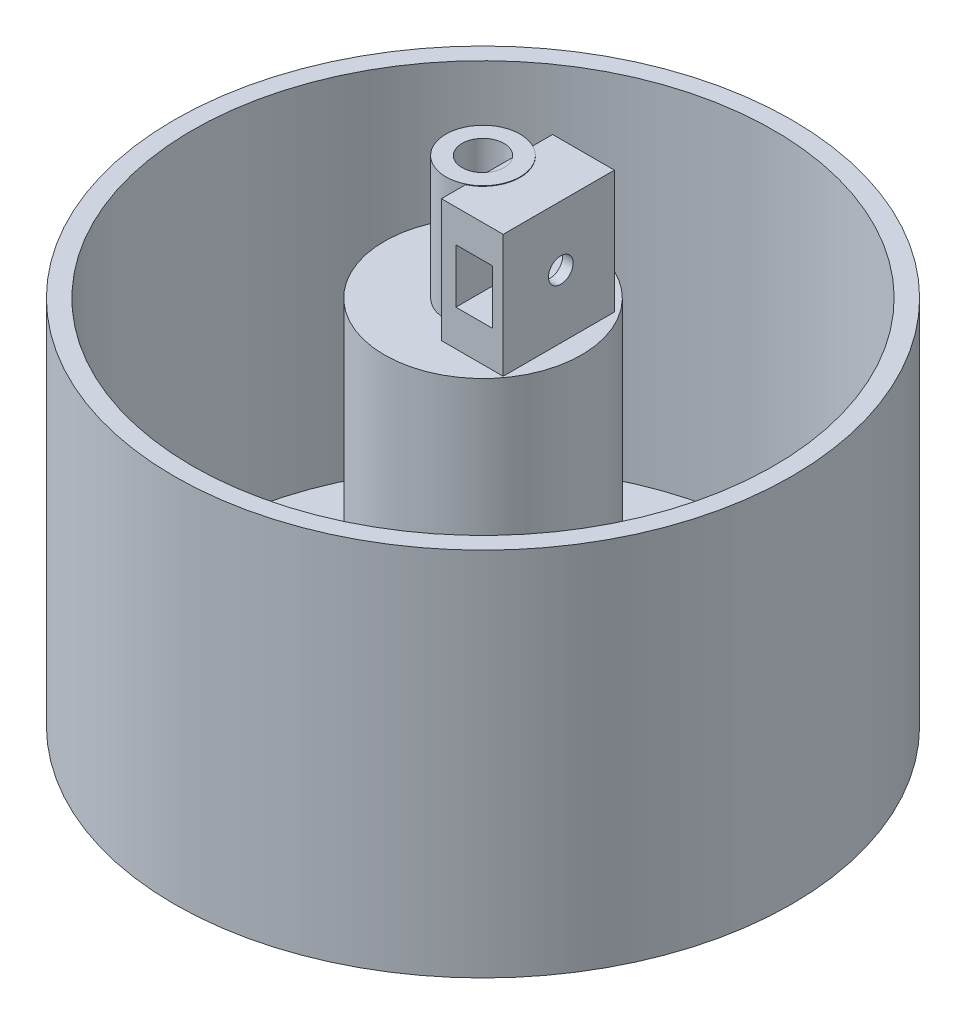
ISO-10303-21;
HEADER;
FILE_DESCRIPTION(('STEP AP214'),'2;1');
FILE_NAME('part.step','',(''),(''),'','','');
FILE_SCHEMA(('AUTOMOTIVE_DESIGN { 1 0 10303 214 1 1 1 1 }'));
ENDSEC;
DATA;
#1=APPLICATION_CONTEXT('core data for automotive mechanical design processes');
#2=APPLICATION_PROTOCOL_DEFINITION('international standard','automotive_design',2000,#1);
#3=PRODUCT_CONTEXT('',#1,'mechanical');
#4=PRODUCT('Part','Part','',(#3));
#5=PRODUCT_RELATED_PRODUCT_CATEGORY('part','',(#4));
#6=PRODUCT_DEFINITION_FORMATION('','',#4);
#7=PRODUCT_DEFINITION_CONTEXT('part definition',#1,'design');
#8=PRODUCT_DEFINITION('design','',#6,#7);
#9=PRODUCT_DEFINITION_SHAPE('','',#8);
#10=(LENGTH_UNIT() NAMED_UNIT(*) SI_UNIT(.MILLI.,.METRE.));
#11=(NAMED_UNIT(*) PLANE_ANGLE_UNIT() SI_UNIT($,.RADIAN.));
#12=(NAMED_UNIT(*) SI_UNIT($,.STERADIAN.) SOLID_ANGLE_UNIT());
#13=UNCERTAINTY_MEASURE_WITH_UNIT(LENGTH_MEASURE(1.E-05),#10,'distance_accuracy_value','');
#14=(GEOMETRIC_REPRESENTATION_CONTEXT(3) GLOBAL_UNCERTAINTY_ASSIGNED_CONTEXT((#13)) GLOBAL_UNIT_ASSIGNED_CONTEXT((#10,
#11,#12)) REPRESENTATION_CONTEXT('',''));
#15=CARTESIAN_POINT('',(0.,0.,0.));
#16=DIRECTION('',(0.,0.,1.));
#17=DIRECTION('',(1.,0.,0.));
#18=AXIS2_PLACEMENT_3D('',#15,#16,#17);
#19=CARTESIAN_POINT('',(0.,0.,0.));
#20=DIRECTION('',(0.,-1.,0.));
#21=DIRECTION('',(0.,0.,-1.));
#22=AXIS2_PLACEMENT_3D('',#19,#20,#21);
#23=PLANE('',#22);
#24=DIRECTION('',(0.,0.,1.));
#25=VECTOR('',#24,1.);
#26=CARTESIAN_POINT('',(2.6,0.,-8.67171590872573));
#27=LINE('',#26,#25);
#28=CARTESIAN_POINT('',(2.6,0.,5.40740233383831));
#29=VERTEX_POINT('',#28);
#30=CARTESIAN_POINT('',(2.6,0.,9.3322603304955));
#31=VERTEX_POINT('',#30);
#32=EDGE_CURVE('E159',#29,#31,#27,.T.);
#33=ORIENTED_EDGE('',*,*,#32,.F.);
#34=CARTESIAN_POINT('',(0.,0.,0.));
#35=DIRECTION('',(0.,1.,0.));
#36=DIRECTION('',(0.,0.,1.));
#37=AXIS2_PLACEMENT_3D('',#34,#35,#36);
#38=CIRCLE('',#37,6.);
#39=CARTESIAN_POINT('',(2.6,0.,-5.40740233383831));
#40=VERTEX_POINT('',#39);
#41=EDGE_CURVE('E189',#40,#29,#38,.T.);
#42=ORIENTED_EDGE('',*,*,#41,.F.);
#43=CARTESIAN_POINT('',(2.6,0.,-8.67171590872573));
#44=VERTEX_POINT('',#43);
#45=EDGE_CURVE('E161',#44,#40,#27,.T.);
#46=ORIENTED_EDGE('',*,*,#45,.F.);
#47=DIRECTION('',(-1.,0.,0.));
#48=VECTOR('',#47,1.);
#49=CARTESIAN_POINT('',(12.6,0.,-8.67171590872573));
#50=LINE('',#49,#48);
#51=CARTESIAN_POINT('',(12.6,0.,-8.67171590872573));
#52=VERTEX_POINT('',#51);
#53=EDGE_CURVE('E144',#52,#44,#50,.T.);
#54=ORIENTED_EDGE('',*,*,#53,.F.);
#55=DIRECTION('',(0.,0.,1.));
#56=VECTOR('',#55,1.);
#57=CARTESIAN_POINT('',(12.6,0.,-8.67171590872573));
#58=LINE('',#57,#56);
#59=CARTESIAN_POINT('',(12.6,0.,9.3322603304955));
#60=VERTEX_POINT('',#59);
#61=EDGE_CURVE('E128',#52,#60,#58,.T.);
#62=ORIENTED_EDGE('',*,*,#61,.T.);
#63=DIRECTION('',(-1.,0.,0.));
#64=VECTOR('',#63,1.);
#65=CARTESIAN_POINT('',(12.6,0.,9.3322603304955));
#66=LINE('',#65,#64);
#67=EDGE_CURVE('E136',#60,#31,#66,.T.);
#68=ORIENTED_EDGE('',*,*,#67,.T.);
#69=EDGE_LOOP('',(#33,#42,#46,#54,#62,#68));
#70=FACE_BOUND('',#69,.T.);
#71=CARTESIAN_POINT('',(0.,0.,0.));
#72=DIRECTION('',(0.,1.,0.));
#73=DIRECTION('',(0.,0.,1.));
#74=AXIS2_PLACEMENT_3D('',#71,#72,#73);
#75=CIRCLE('',#74,15.9579008899185);
#76=CARTESIAN_POINT('',(0.,0.,15.9579008899185));
#77=VERTEX_POINT('',#76);
#78=EDGE_CURVE('E313',#77,#77,#75,.T.);
#79=ORIENTED_EDGE('',*,*,#78,.T.);
#80=EDGE_LOOP('',(#79));
#81=FACE_BOUND('',#80,.T.);
#82=ADVANCED_FACE('F35',(#70,#81),#23,.F.);
#83=CARTESIAN_POINT('',(12.6,19.9099600410235,-8.67171590872573));
#84=DIRECTION('',(0.,0.,-1.));
#85=DIRECTION('',(0.,1.,0.));
#86=AXIS2_PLACEMENT_3D('',#83,#84,#85);
#87=PLANE('',#86);
#88=DIRECTION('',(0.,-1.,0.));
#89=VECTOR('',#88,1.);
#90=CARTESIAN_POINT('',(2.6,19.9099600410235,-8.67171590872573));
#91=LINE('',#90,#89);
#92=CARTESIAN_POINT('',(2.6,19.9099600410235,-8.67171590872573));
#93=VERTEX_POINT('',#92);
#94=EDGE_CURVE('E156',#93,#44,#91,.T.);
#95=ORIENTED_EDGE('',*,*,#94,.F.);
#96=DIRECTION('',(-1.,0.,0.));
#97=VECTOR('',#96,1.);
#98=CARTESIAN_POINT('',(12.6,19.9099600410235,-8.67171590872573));
#99=LINE('',#98,#97);
#100=CARTESIAN_POINT('',(12.6,19.9099600410235,-8.67171590872573));
#101=VERTEX_POINT('',#100);
#102=EDGE_CURVE('E167',#101,#93,#99,.T.);
#103=ORIENTED_EDGE('',*,*,#102,.F.);
#104=DIRECTION('',(0.,-1.,0.));
#105=VECTOR('',#104,1.);
#106=CARTESIAN_POINT('',(12.6,19.9099600410235,-8.67171590872573));
#107=LINE('',#106,#105);
#108=EDGE_CURVE('E149',#101,#52,#107,.T.);
#109=ORIENTED_EDGE('',*,*,#108,.T.);
#110=ORIENTED_EDGE('',*,*,#53,.T.);
#111=EDGE_LOOP('',(#95,#103,#109,#110));
#112=FACE_BOUND('',#111,.T.);
#113=DIRECTION('',(0.,1.,0.));
#114=VECTOR('',#113,1.);
#115=CARTESIAN_POINT('',(10.8765163816997,19.9099600410235,-8.67171590872573));
#116=LINE('',#115,#114);
#117=CARTESIAN_POINT('',(10.8765163816997,5.86192553685862,-8.67171590872573));
#118=VERTEX_POINT('',#117);
#119=CARTESIAN_POINT('',(10.8765163816997,14.6143324449,-8.67171590872573));
#120=VERTEX_POINT('',#119);
#121=EDGE_CURVE('E214',#118,#120,#116,.T.);
#122=ORIENTED_EDGE('',*,*,#121,.T.);
#123=DIRECTION('',(-1.,0.,0.));
#124=VECTOR('',#123,1.);
#125=CARTESIAN_POINT('',(12.6,14.6143324449,-8.67171590872573));
#126=LINE('',#125,#124);
#127=CARTESIAN_POINT('',(4.94343022694287,14.6143324449,-8.67171590872573));
#128=VERTEX_POINT('',#127);
#129=EDGE_CURVE('E206',#120,#128,#126,.T.);
#130=ORIENTED_EDGE('',*,*,#129,.T.);
#131=DIRECTION('',(0.,-1.,0.));
#132=VECTOR('',#131,1.);
#133=CARTESIAN_POINT('',(4.94343022694287,19.9099600410235,-8.67171590872573));
#134=LINE('',#133,#132);
#135=CARTESIAN_POINT('',(4.94343022694287,5.86192553685862,-8.67171590872573));
#136=VERTEX_POINT('',#135);
#137=EDGE_CURVE('E240',#128,#136,#134,.T.);
#138=ORIENTED_EDGE('',*,*,#137,.T.);
#139=DIRECTION('',(1.,0.,0.));
#140=VECTOR('',#139,1.);
#141=CARTESIAN_POINT('',(12.6,5.86192553685862,-8.67171590872573));
#142=LINE('',#141,#140);
#143=EDGE_CURVE('E224',#136,#118,#142,.T.);
#144=ORIENTED_EDGE('',*,*,#143,.T.);
#145=EDGE_LOOP('',(#122,#130,#138,#144));
#146=FACE_BOUND('',#145,.T.);
#147=ADVANCED_FACE('F264',(#112,#146),#87,.T.);
#148=CARTESIAN_POINT('',(12.6,19.9099600410235,9.3322603304955));
#149=DIRECTION('',(0.,0.,1.));
#150=DIRECTION('',(0.,-1.,0.));
#151=AXIS2_PLACEMENT_3D('',#148,#149,#150);
#152=PLANE('',#151);
#153=DIRECTION('',(0.,1.,0.));
#154=VECTOR('',#153,1.);
#155=CARTESIAN_POINT('',(2.6,19.9099600410235,9.3322603304955));
#156=LINE('',#155,#154);
#157=CARTESIAN_POINT('',(2.6,19.9099600410235,9.3322603304955));
#158=VERTEX_POINT('',#157);
#159=EDGE_CURVE('E140',#31,#158,#156,.T.);
#160=ORIENTED_EDGE('',*,*,#159,.F.);
#161=ORIENTED_EDGE('',*,*,#67,.F.);
#162=DIRECTION('',(0.,1.,0.));
#163=VECTOR('',#162,1.);
#164=CARTESIAN_POINT('',(12.6,19.9099600410235,9.3322603304955));
#165=LINE('',#164,#163);
#166=CARTESIAN_POINT('',(12.6,19.9099600410235,9.3322603304955));
#167=VERTEX_POINT('',#166);
#168=EDGE_CURVE('E123',#60,#167,#165,.T.);
#169=ORIENTED_EDGE('',*,*,#168,.T.);
#170=DIRECTION('',(-1.,0.,0.));
#171=VECTOR('',#170,1.);
#172=CARTESIAN_POINT('',(12.6,19.9099600410235,9.3322603304955));
#173=LINE('',#172,#171);
#174=EDGE_CURVE('E143',#167,#158,#173,.T.);
#175=ORIENTED_EDGE('',*,*,#174,.T.);
#176=EDGE_LOOP('',(#160,#161,#169,#175));
#177=FACE_BOUND('',#176,.T.);
#178=DIRECTION('',(0.,1.,0.));
#179=VECTOR('',#178,1.);
#180=CARTESIAN_POINT('',(4.94343022694287,19.9099600410235,9.3322603304955));
#181=LINE('',#180,#179);
#182=CARTESIAN_POINT('',(4.94343022694287,5.86192553685862,9.3322603304955));
#183=VERTEX_POINT('',#182);
#184=CARTESIAN_POINT('',(4.94343022694287,14.6143324449,9.3322603304955));
#185=VERTEX_POINT('',#184);
#186=EDGE_CURVE('E213',#183,#185,#181,.T.);
#187=ORIENTED_EDGE('',*,*,#186,.T.);
#188=DIRECTION('',(1.,0.,0.));
#189=VECTOR('',#188,1.);
#190=CARTESIAN_POINT('',(12.6,14.6143324449,9.3322603304955));
#191=LINE('',#190,#189);
#192=CARTESIAN_POINT('',(10.8765163816997,14.6143324449,9.3322603304955));
#193=VERTEX_POINT('',#192);
#194=EDGE_CURVE('E11',#185,#193,#191,.T.);
#195=ORIENTED_EDGE('',*,*,#194,.T.);
#196=DIRECTION('',(0.,-1.,0.));
#197=VECTOR('',#196,1.);
#198=CARTESIAN_POINT('',(10.8765163816997,19.9099600410235,9.3322603304955));
#199=LINE('',#198,#197);
#200=CARTESIAN_POINT('',(10.8765163816997,5.86192553685862,9.3322603304955));
#201=VERTEX_POINT('',#200);
#202=EDGE_CURVE('E210',#193,#201,#199,.T.);
#203=ORIENTED_EDGE('',*,*,#202,.T.);
#204=DIRECTION('',(-1.,0.,0.));
#205=VECTOR('',#204,1.);
#206=CARTESIAN_POINT('',(12.6,5.86192553685862,9.3322603304955));
#207=LINE('',#206,#205);
#208=EDGE_CURVE('E43',#201,#183,#207,.T.);
#209=ORIENTED_EDGE('',*,*,#208,.T.);
#210=EDGE_LOOP('',(#187,#195,#203,#209));
#211=FACE_BOUND('',#210,.T.);
#212=ADVANCED_FACE('F137',(#177,#211),#152,.T.);
#213=CARTESIAN_POINT('',(1.6,10.2369255368586,0.));
#214=DIRECTION('',(1.,0.,0.));
#215=DIRECTION('',(0.,0.,-1.));
#216=AXIS2_PLACEMENT_3D('',#213,#214,#215);
#217=CYLINDRICAL_SURFACE('',#216,2.);
#218=CARTESIAN_POINT('',(2.6,10.2369255368586,0.));
#219=DIRECTION('',(-1.,0.,0.));
#220=DIRECTION('',(0.,0.,1.));
#221=AXIS2_PLACEMENT_3D('',#218,#219,#220);
#222=CIRCLE('',#221,2.);
#223=CARTESIAN_POINT('',(2.6,10.2369255368586,2.));
#224=VERTEX_POINT('',#223);
#225=EDGE_CURVE('E160',#224,#224,#222,.F.);
#226=ORIENTED_EDGE('',*,*,#225,.F.);
#227=EDGE_LOOP('',(#226));
#228=FACE_BOUND('',#227,.T.);
#229=CARTESIAN_POINT('',(4.94343022694287,10.2369255368586,0.));
#230=DIRECTION('',(1.,0.,0.));
#231=DIRECTION('',(0.,0.,-1.));
#232=AXIS2_PLACEMENT_3D('',#229,#230,#231);
#233=CIRCLE('',#232,2.);
#234=CARTESIAN_POINT('',(4.94343022694287,10.2369255368586,-2.));
#235=VERTEX_POINT('',#234);
#236=EDGE_CURVE('E211',#235,#235,#233,.T.);
#237=ORIENTED_EDGE('',*,*,#236,.T.);
#238=EDGE_LOOP('',(#237));
#239=FACE_BOUND('',#238,.T.);
#240=ADVANCED_FACE('F250',(#228,#239),#217,.F.);
#241=CARTESIAN_POINT('',(12.6,10.2369255368586,0.));
#242=DIRECTION('',(-1.,0.,0.));
#243=DIRECTION('',(0.,0.,1.));
#244=AXIS2_PLACEMENT_3D('',#241,#242,#243);
#245=CIRCLE('',#244,2.);
#246=CARTESIAN_POINT('',(12.6,10.2369255368586,2.));
#247=VERTEX_POINT('',#246);
#248=EDGE_CURVE('E203',#247,#247,#245,.F.);
#249=ORIENTED_EDGE('',*,*,#248,.T.);
#250=EDGE_LOOP('',(#249));
#251=FACE_BOUND('',#250,.T.);
#252=CARTESIAN_POINT('',(10.8765163816997,10.2369255368586,0.));
#253=DIRECTION('',(-1.,0.,0.));
#254=DIRECTION('',(0.,0.,1.));
#255=AXIS2_PLACEMENT_3D('',#252,#253,#254);
#256=CIRCLE('',#255,2.);
#257=CARTESIAN_POINT('',(10.8765163816997,10.2369255368586,2.));
#258=VERTEX_POINT('',#257);
#259=EDGE_CURVE('E207',#258,#258,#256,.T.);
#260=ORIENTED_EDGE('',*,*,#259,.T.);
#261=EDGE_LOOP('',(#260));
#262=FACE_BOUND('',#261,.T.);
#263=ADVANCED_FACE('F253',(#251,#262),#217,.F.);
#264=CARTESIAN_POINT('',(0.,20.,0.));
#265=DIRECTION('',(0.,-1.,0.));
#266=DIRECTION('',(0.,0.,-1.));
#267=AXIS2_PLACEMENT_3D('',#264,#265,#266);
#268=CYLINDRICAL_SURFACE('',#267,6.);
#269=CARTESIAN_POINT('',(0.,20.,0.));
#270=DIRECTION('',(0.,1.,0.));
#271=DIRECTION('',(0.,0.,1.));
#272=AXIS2_PLACEMENT_3D('',#269,#270,#271);
#273=CIRCLE('',#272,6.);
#274=CARTESIAN_POINT('',(0.,20.,6.));
#275=VERTEX_POINT('',#274);
#276=EDGE_CURVE('E192',#275,#275,#273,.T.);
#277=ORIENTED_EDGE('',*,*,#276,.F.);
#278=EDGE_LOOP('',(#277));
#279=FACE_BOUND('',#278,.T.);
#280=CARTESIAN_POINT('',(0.,19.9099600410235,0.));
#281=DIRECTION('',(0.,1.,0.));
#282=DIRECTION('',(0.,0.,1.));
#283=AXIS2_PLACEMENT_3D('',#280,#281,#282);
#284=CIRCLE('',#283,6.);
#285=CARTESIAN_POINT('',(2.6,19.9099600410235,5.40740233383831));
#286=VERTEX_POINT('',#285);
#287=CARTESIAN_POINT('',(2.6,19.9099600410235,-5.40740233383831));
#288=VERTEX_POINT('',#287);
#289=EDGE_CURVE('E178',#286,#288,#284,.T.);
#290=ORIENTED_EDGE('',*,*,#289,.T.);
#291=DIRECTION('',(0.,-1.,0.));
#292=VECTOR('',#291,1.);
#293=CARTESIAN_POINT('',(2.6,20.,-5.40740233383831));
#294=LINE('',#293,#292);
#295=EDGE_CURVE('E175',#288,#40,#294,.T.);
#296=ORIENTED_EDGE('',*,*,#295,.T.);
#297=ORIENTED_EDGE('',*,*,#41,.T.);
#298=DIRECTION('',(0.,-1.,0.));
#299=VECTOR('',#298,1.);
#300=CARTESIAN_POINT('',(2.6,20.,5.40740233383831));
#301=LINE('',#300,#299);
#302=EDGE_CURVE('E170',#29,#286,#301,.F.);
#303=ORIENTED_EDGE('',*,*,#302,.T.);
#304=EDGE_LOOP('',(#290,#296,#297,#303));
#305=FACE_BOUND('',#304,.T.);
#306=ADVANCED_FACE('F37',(#279,#305),#268,.T.);
#307=CARTESIAN_POINT('',(0.,20.,0.));
#308=DIRECTION('',(0.,1.,0.));
#309=DIRECTION('',(0.,0.,1.));
#310=AXIS2_PLACEMENT_3D('',#307,#308,#309);
#311=PLANE('',#310);
#312=CARTESIAN_POINT('',(0.,20.,0.));
#313=DIRECTION('',(0.,1.,0.));
#314=DIRECTION('',(0.,0.,1.));
#315=AXIS2_PLACEMENT_3D('',#312,#313,#314);
#316=CIRCLE('',#315,3.4);
#317=CARTESIAN_POINT('',(0.,20.,3.4));
#318=VERTEX_POINT('',#317);
#319=EDGE_CURVE('E186',#318,#318,#316,.T.);
#320=ORIENTED_EDGE('',*,*,#319,.F.);
#321=EDGE_LOOP('',(#320));
#322=FACE_BOUND('',#321,.T.);
#323=ORIENTED_EDGE('',*,*,#276,.T.);
#324=EDGE_LOOP('',(#323));
#325=FACE_BOUND('',#324,.T.);
#326=ADVANCED_FACE('F385',(#322,#325),#311,.T.);
#327=CARTESIAN_POINT('',(0.,6.45,0.));
#328=DIRECTION('',(0.,1.,0.));
#329=DIRECTION('',(0.,0.,1.));
#330=AXIS2_PLACEMENT_3D('',#327,#328,#329);
#331=CYLINDRICAL_SURFACE('',#330,3.4);
#332=CARTESIAN_POINT('',(0.,19.9099600410235,0.));
#333=DIRECTION('',(0.,1.,0.));
#334=DIRECTION('',(0.,0.,1.));
#335=AXIS2_PLACEMENT_3D('',#332,#333,#334);
#336=CIRCLE('',#335,3.4);
#337=CARTESIAN_POINT('',(2.6,19.9099600410235,-2.19089023002066));
#338=VERTEX_POINT('',#337);
#339=CARTESIAN_POINT('',(2.6,19.9099600410235,2.19089023002066));
#340=VERTEX_POINT('',#339);
#341=EDGE_CURVE('E200',#338,#340,#336,.F.);
#342=ORIENTED_EDGE('',*,*,#341,.T.);
#343=DIRECTION('',(0.,1.,0.));
#344=VECTOR('',#343,1.);
#345=CARTESIAN_POINT('',(2.6,6.45,2.19089023002067));
#346=LINE('',#345,#344);
#347=CARTESIAN_POINT('',(2.6,6.45,2.19089023002066));
#348=VERTEX_POINT('',#347);
#349=EDGE_CURVE('E183',#340,#348,#346,.F.);
#350=ORIENTED_EDGE('',*,*,#349,.T.);
#351=CARTESIAN_POINT('',(0.,6.45,0.));
#352=DIRECTION('',(0.,1.,0.));
#353=DIRECTION('',(0.,0.,1.));
#354=AXIS2_PLACEMENT_3D('',#351,#352,#353);
#355=CIRCLE('',#354,3.4);
#356=CARTESIAN_POINT('',(2.6,6.45,-2.19089023002066));
#357=VERTEX_POINT('',#356);
#358=EDGE_CURVE('E187',#357,#348,#355,.T.);
#359=ORIENTED_EDGE('',*,*,#358,.F.);
#360=DIRECTION('',(0.,1.,0.));
#361=VECTOR('',#360,1.);
#362=CARTESIAN_POINT('',(2.6,6.45,-2.19089023002067));
#363=LINE('',#362,#361);
#364=EDGE_CURVE('E181',#357,#338,#363,.T.);
#365=ORIENTED_EDGE('',*,*,#364,.T.);
#366=EDGE_LOOP('',(#342,#350,#359,#365));
#367=FACE_BOUND('',#366,.T.);
#368=ORIENTED_EDGE('',*,*,#319,.T.);
#369=EDGE_LOOP('',(#368));
#370=FACE_BOUND('',#369,.T.);
#371=ADVANCED_FACE('F471',(#367,#370),#331,.F.);
#372=CARTESIAN_POINT('',(0.,6.45,0.));
#373=DIRECTION('',(0.,1.,0.));
#374=DIRECTION('',(0.,0.,1.));
#375=AXIS2_PLACEMENT_3D('',#372,#373,#374);
#376=PLANE('',#375);
#377=DIRECTION('',(0.,0.,1.));
#378=VECTOR('',#377,1.);
#379=CARTESIAN_POINT('',(2.6,6.45,0.));
#380=LINE('',#379,#378);
#381=EDGE_CURVE('E195',#357,#348,#380,.T.);
#382=ORIENTED_EDGE('',*,*,#381,.F.);
#383=ORIENTED_EDGE('',*,*,#358,.T.);
#384=EDGE_LOOP('',(#382,#383));
#385=FACE_BOUND('',#384,.T.);
#386=ADVANCED_FACE('F449',(#385),#376,.T.);
#387=CARTESIAN_POINT('',(2.6,4.71,3.57158819939229));
#388=DIRECTION('',(-1.,0.,0.));
#389=DIRECTION('',(0.,0.,1.));
#390=AXIS2_PLACEMENT_3D('',#387,#388,#389);
#391=PLANE('',#390);
#392=ORIENTED_EDGE('',*,*,#225,.T.);
#393=EDGE_LOOP('',(#392));
#394=FACE_BOUND('',#393,.T.);
#395=ORIENTED_EDGE('',*,*,#349,.F.);
#396=DIRECTION('',(0.,0.,-1.));
#397=VECTOR('',#396,1.);
#398=CARTESIAN_POINT('',(2.6,19.9099600410235,-8.67171590872573));
#399=LINE('',#398,#397);
#400=EDGE_CURVE('E166',#340,#338,#399,.T.);
#401=ORIENTED_EDGE('',*,*,#400,.T.);
#402=ORIENTED_EDGE('',*,*,#364,.F.);
#403=ORIENTED_EDGE('',*,*,#381,.T.);
#404=EDGE_LOOP('',(#395,#401,#402,#403));
#405=FACE_BOUND('',#404,.T.);
#406=ADVANCED_FACE('F247',(#394,#405),#391,.T.);
#407=CARTESIAN_POINT('',(12.6,19.9099600410235,-8.67171590872573));
#408=DIRECTION('',(0.,1.,0.));
#409=DIRECTION('',(0.,0.,1.));
#410=AXIS2_PLACEMENT_3D('',#407,#408,#409);
#411=PLANE('',#410);
#412=ORIENTED_EDGE('',*,*,#341,.F.);
#413=ORIENTED_EDGE('',*,*,#400,.F.);
#414=EDGE_LOOP('',(#412,#413));
#415=FACE_BOUND('',#414,.T.);
#416=ADVANCED_FACE('F448',(#415),#411,.T.);
#417=ORIENTED_EDGE('',*,*,#289,.F.);
#418=EDGE_CURVE('E151',#158,#286,#399,.T.);
#419=ORIENTED_EDGE('',*,*,#418,.F.);
#420=ORIENTED_EDGE('',*,*,#174,.F.);
#421=DIRECTION('',(0.,0.,-1.));
#422=VECTOR('',#421,1.);
#423=CARTESIAN_POINT('',(12.6,19.9099600410235,-8.67171590872573));
#424=LINE('',#423,#422);
#425=EDGE_CURVE('E131',#167,#101,#424,.T.);
#426=ORIENTED_EDGE('',*,*,#425,.T.);
#427=ORIENTED_EDGE('',*,*,#102,.T.);
#428=EDGE_CURVE('E164',#288,#93,#399,.T.);
#429=ORIENTED_EDGE('',*,*,#428,.F.);
#430=EDGE_LOOP('',(#417,#419,#420,#426,#427,#429));
#431=FACE_BOUND('',#430,.T.);
#432=ADVANCED_FACE('F374',(#431),#411,.T.);
#433=CARTESIAN_POINT('',(2.6,0.,0.));
#434=DIRECTION('',(-1.,0.,0.));
#435=DIRECTION('',(0.,0.,1.));
#436=AXIS2_PLACEMENT_3D('',#433,#434,#435);
#437=PLANE('',#436);
#438=ORIENTED_EDGE('',*,*,#295,.F.);
#439=ORIENTED_EDGE('',*,*,#428,.T.);
#440=ORIENTED_EDGE('',*,*,#94,.T.);
#441=ORIENTED_EDGE('',*,*,#45,.T.);
#442=EDGE_LOOP('',(#438,#439,#440,#441));
#443=FACE_BOUND('',#442,.T.);
#444=ADVANCED_FACE('F364',(#443),#437,.T.);
#445=ORIENTED_EDGE('',*,*,#302,.F.);
#446=ORIENTED_EDGE('',*,*,#32,.T.);
#447=ORIENTED_EDGE('',*,*,#159,.T.);
#448=ORIENTED_EDGE('',*,*,#418,.T.);
#449=EDGE_LOOP('',(#445,#446,#447,#448));
#450=FACE_BOUND('',#449,.T.);
#451=ADVANCED_FACE('F352',(#450),#437,.T.);
#452=CARTESIAN_POINT('',(12.6,0.,0.));
#453=DIRECTION('',(-1.,0.,0.));
#454=DIRECTION('',(0.,0.,1.));
#455=AXIS2_PLACEMENT_3D('',#452,#453,#454);
#456=PLANE('',#455);
#457=ORIENTED_EDGE('',*,*,#248,.F.);
#458=EDGE_LOOP('',(#457));
#459=FACE_BOUND('',#458,.T.);
#460=ORIENTED_EDGE('',*,*,#108,.F.);
#461=ORIENTED_EDGE('',*,*,#425,.F.);
#462=ORIENTED_EDGE('',*,*,#168,.F.);
#463=ORIENTED_EDGE('',*,*,#61,.F.);
#464=EDGE_LOOP('',(#460,#461,#462,#463));
#465=FACE_BOUND('',#464,.T.);
#466=ADVANCED_FACE('F126',(#459,#465),#456,.F.);
#467=CARTESIAN_POINT('',(4.94343022694287,14.6143324449,10.));
#468=DIRECTION('',(0.,-1.,0.));
#469=DIRECTION('',(0.,0.,-1.));
#470=AXIS2_PLACEMENT_3D('',#467,#468,#469);
#471=PLANE('',#470);
#472=DIRECTION('',(0.,0.,-1.));
#473=VECTOR('',#472,1.);
#474=CARTESIAN_POINT('',(10.8765163816997,14.6143324449,10.));
#475=LINE('',#474,#473);
#476=EDGE_CURVE('E50',#193,#120,#475,.T.);
#477=ORIENTED_EDGE('',*,*,#476,.F.);
#478=ORIENTED_EDGE('',*,*,#194,.F.);
#479=DIRECTION('',(0.,0.,-1.));
#480=VECTOR('',#479,1.);
#481=CARTESIAN_POINT('',(4.94343022694287,14.6143324449,10.));
#482=LINE('',#481,#480);
#483=EDGE_CURVE('E227',#185,#128,#482,.T.);
#484=ORIENTED_EDGE('',*,*,#483,.T.);
#485=ORIENTED_EDGE('',*,*,#129,.F.);
#486=EDGE_LOOP('',(#477,#478,#484,#485));
#487=FACE_BOUND('',#486,.T.);
#488=ADVANCED_FACE('F259',(#487),#471,.T.);
#489=CARTESIAN_POINT('',(4.94343022694287,5.86192553685862,10.));
#490=DIRECTION('',(1.,0.,0.));
#491=DIRECTION('',(0.,0.,-1.));
#492=AXIS2_PLACEMENT_3D('',#489,#490,#491);
#493=PLANE('',#492);
#494=ORIENTED_EDGE('',*,*,#236,.F.);
#495=EDGE_LOOP('',(#494));
#496=FACE_BOUND('',#495,.T.);
#497=ORIENTED_EDGE('',*,*,#483,.F.);
#498=ORIENTED_EDGE('',*,*,#186,.F.);
#499=DIRECTION('',(0.,0.,-1.));
#500=VECTOR('',#499,1.);
#501=CARTESIAN_POINT('',(4.94343022694287,5.86192553685862,10.));
#502=LINE('',#501,#500);
#503=EDGE_CURVE('E223',#183,#136,#502,.T.);
#504=ORIENTED_EDGE('',*,*,#503,.T.);
#505=ORIENTED_EDGE('',*,*,#137,.F.);
#506=EDGE_LOOP('',(#497,#498,#504,#505));
#507=FACE_BOUND('',#506,.T.);
#508=ADVANCED_FACE('F257',(#496,#507),#493,.T.);
#509=CARTESIAN_POINT('',(4.94343022694287,5.86192553685862,10.));
#510=DIRECTION('',(0.,1.,0.));
#511=DIRECTION('',(0.,0.,1.));
#512=AXIS2_PLACEMENT_3D('',#509,#510,#511);
#513=PLANE('',#512);
#514=ORIENTED_EDGE('',*,*,#503,.F.);
#515=ORIENTED_EDGE('',*,*,#208,.F.);
#516=DIRECTION('',(0.,0.,-1.));
#517=VECTOR('',#516,1.);
#518=CARTESIAN_POINT('',(10.8765163816997,5.86192553685862,10.));
#519=LINE('',#518,#517);
#520=EDGE_CURVE('E55',#201,#118,#519,.T.);
#521=ORIENTED_EDGE('',*,*,#520,.T.);
#522=ORIENTED_EDGE('',*,*,#143,.F.);
#523=EDGE_LOOP('',(#514,#515,#521,#522));
#524=FACE_BOUND('',#523,.T.);
#525=ADVANCED_FACE('F220',(#524),#513,.T.);
#526=CARTESIAN_POINT('',(10.8765163816997,10.2369255368586,10.));
#527=DIRECTION('',(-1.,0.,0.));
#528=DIRECTION('',(0.,0.,1.));
#529=AXIS2_PLACEMENT_3D('',#526,#527,#528);
#530=PLANE('',#529);
#531=ORIENTED_EDGE('',*,*,#259,.F.);
#532=EDGE_LOOP('',(#531));
#533=FACE_BOUND('',#532,.T.);
#534=ORIENTED_EDGE('',*,*,#520,.F.);
#535=ORIENTED_EDGE('',*,*,#202,.F.);
#536=ORIENTED_EDGE('',*,*,#476,.T.);
#537=ORIENTED_EDGE('',*,*,#121,.F.);
#538=EDGE_LOOP('',(#534,#535,#536,#537));
#539=FACE_BOUND('',#538,.T.);
#540=ADVANCED_FACE('F265',(#533,#539),#530,.T.);
#541=CARTESIAN_POINT('',(0.,-57.,0.));
#542=DIRECTION('',(0.,1.,0.));
#543=DIRECTION('',(0.,0.,1.));
#544=AXIS2_PLACEMENT_3D('',#541,#542,#543);
#545=CYLINDRICAL_SURFACE('',#544,47.0827643729237);
#546=CARTESIAN_POINT('',(0.,-57.,0.));
#547=DIRECTION('',(0.,1.,0.));
#548=DIRECTION('',(0.,0.,1.));
#549=AXIS2_PLACEMENT_3D('',#546,#547,#548);
#550=CIRCLE('',#549,47.0827643729237);
#551=CARTESIAN_POINT('',(0.,-57.,47.0827643729237));
#552=VERTEX_POINT('',#551);
#553=EDGE_CURVE('E305',#552,#552,#550,.T.);
#554=ORIENTED_EDGE('',*,*,#553,.F.);
#555=EDGE_LOOP('',(#554));
#556=FACE_BOUND('',#555,.T.);
#557=CARTESIAN_POINT('',(0.,0.,0.));
#558=DIRECTION('',(0.,1.,0.));
#559=DIRECTION('',(0.,0.,1.));
#560=AXIS2_PLACEMENT_3D('',#557,#558,#559);
#561=CIRCLE('',#560,47.0827643729237);
#562=CARTESIAN_POINT('',(0.,0.,47.0827643729237));
#563=VERTEX_POINT('',#562);
#564=EDGE_CURVE('E300',#563,#563,#561,.T.);
#565=ORIENTED_EDGE('',*,*,#564,.T.);
#566=EDGE_LOOP('',(#565));
#567=FACE_BOUND('',#566,.T.);
#568=ADVANCED_FACE('F267',(#556,#567),#545,.F.);
#569=CARTESIAN_POINT('',(0.,-57.,0.));
#570=DIRECTION('',(0.,1.,0.));
#571=DIRECTION('',(0.,0.,1.));
#572=AXIS2_PLACEMENT_3D('',#569,#570,#571);
#573=PLANE('',#572);
#574=CARTESIAN_POINT('',(0.,-57.,0.));
#575=DIRECTION('',(0.,1.,0.));
#576=DIRECTION('',(0.,0.,1.));
#577=AXIS2_PLACEMENT_3D('',#574,#575,#576);
#578=CIRCLE('',#577,15.9579008899185);
#579=CARTESIAN_POINT('',(0.,-57.,15.9579008899185));
#580=VERTEX_POINT('',#579);
#581=EDGE_CURVE('E311',#580,#580,#578,.T.);
#582=ORIENTED_EDGE('',*,*,#581,.F.);
#583=EDGE_LOOP('',(#582));
#584=FACE_BOUND('',#583,.T.);
#585=ORIENTED_EDGE('',*,*,#553,.T.);
#586=EDGE_LOOP('',(#585));
#587=FACE_BOUND('',#586,.T.);
#588=ADVANCED_FACE('F274',(#584,#587),#573,.T.);
#589=CARTESIAN_POINT('',(0.,-57.,0.));
#590=DIRECTION('',(0.,1.,0.));
#591=DIRECTION('',(0.,0.,1.));
#592=AXIS2_PLACEMENT_3D('',#589,#590,#591);
#593=CYLINDRICAL_SURFACE('',#592,15.9579008899185);
#594=ORIENTED_EDGE('',*,*,#581,.T.);
#595=EDGE_LOOP('',(#594));
#596=FACE_BOUND('',#595,.T.);
#597=ORIENTED_EDGE('',*,*,#78,.F.);
#598=EDGE_LOOP('',(#597));
#599=FACE_BOUND('',#598,.T.);
#600=ADVANCED_FACE('F319',(#596,#599),#593,.T.);
#601=CARTESIAN_POINT('',(0.,-60.,0.));
#602=DIRECTION('',(0.,-1.,0.));
#603=DIRECTION('',(0.,0.,-1.));
#604=AXIS2_PLACEMENT_3D('',#601,#602,#603);
#605=PLANE('',#604);
#606=CARTESIAN_POINT('',(0.,-60.,0.));
#607=DIRECTION('',(0.,-1.,0.));
#608=DIRECTION('',(0.,0.,-1.));
#609=AXIS2_PLACEMENT_3D('',#606,#607,#608);
#610=CIRCLE('',#609,50.);
#611=CARTESIAN_POINT('',(0.,-60.,-50.));
#612=VERTEX_POINT('',#611);
#613=EDGE_CURVE('E231',#612,#612,#610,.T.);
#614=ORIENTED_EDGE('',*,*,#613,.T.);
#615=EDGE_LOOP('',(#614));
#616=FACE_BOUND('',#615,.T.);
#617=ADVANCED_FACE('F295',(#616),#605,.T.);
#618=CARTESIAN_POINT('',(0.,-60.,0.));
#619=DIRECTION('',(0.,1.,0.));
#620=DIRECTION('',(0.,0.,1.));
#621=AXIS2_PLACEMENT_3D('',#618,#619,#620);
#622=CYLINDRICAL_SURFACE('',#621,50.);
#623=ORIENTED_EDGE('',*,*,#613,.F.);
#624=EDGE_LOOP('',(#623));
#625=FACE_BOUND('',#624,.T.);
#626=CARTESIAN_POINT('',(0.,0.,0.));
#627=DIRECTION('',(0.,-1.,0.));
#628=DIRECTION('',(0.,0.,-1.));
#629=AXIS2_PLACEMENT_3D('',#626,#627,#628);
#630=CIRCLE('',#629,50.);
#631=CARTESIAN_POINT('',(0.,0.,-50.));
#632=VERTEX_POINT('',#631);
#633=EDGE_CURVE('E303',#632,#632,#630,.T.);
#634=ORIENTED_EDGE('',*,*,#633,.T.);
#635=EDGE_LOOP('',(#634));
#636=FACE_BOUND('',#635,.T.);
#637=ADVANCED_FACE('F290',(#625,#636),#622,.T.);
#638=ORIENTED_EDGE('',*,*,#564,.F.);
#639=EDGE_LOOP('',(#638));
#640=FACE_BOUND('',#639,.T.);
#641=ORIENTED_EDGE('',*,*,#633,.F.);
#642=EDGE_LOOP('',(#641));
#643=FACE_BOUND('',#642,.T.);
#644=ADVANCED_FACE('F282',(#640,#643),#23,.F.);
#645=CLOSED_SHELL('',(#82,#147,#212,#240,#263,#306,#326,#371,#386,#406,#416,#432,#444,#451,#466,
#488,#508,#525,#540,#568,#588,#600,#617,#637,#644));
#646=MANIFOLD_SOLID_BREP('B2',#645);
#647=ADVANCED_BREP_SHAPE_REPRESENTATION('',(#18,#646),#14);
#648=SHAPE_DEFINITION_REPRESENTATION(#9,#647);
ENDSEC;
END-ISO-10303-21;
